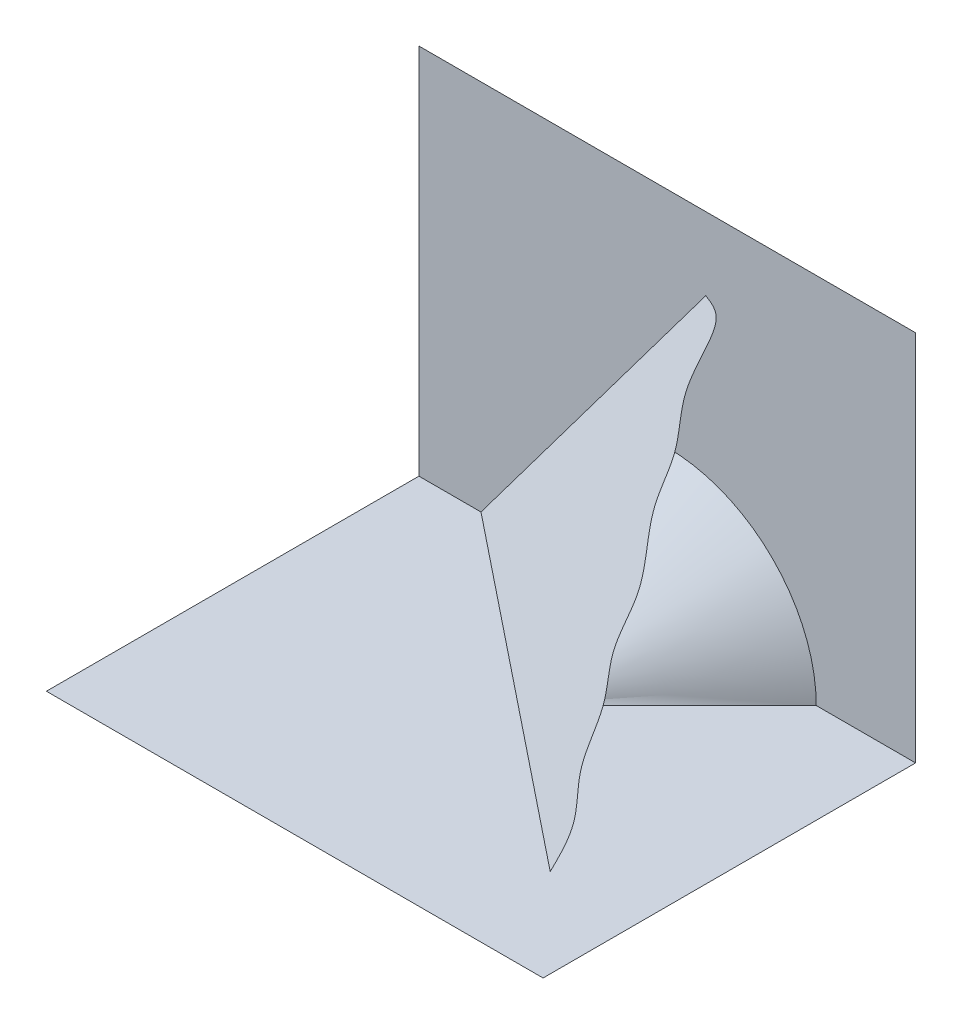
ISO-10303-21;
HEADER;
FILE_DESCRIPTION(('STEP AP214'),'2;1');
FILE_NAME('part.step','',(''),(''),'','','');
FILE_SCHEMA(('AUTOMOTIVE_DESIGN { 1 0 10303 214 1 1 1 1 }'));
ENDSEC;
DATA;
#1=APPLICATION_CONTEXT('core data for automotive mechanical design processes');
#2=APPLICATION_PROTOCOL_DEFINITION('international standard','automotive_design',2000,#1);
#3=PRODUCT_CONTEXT('',#1,'mechanical');
#4=PRODUCT('Part','Part','',(#3));
#5=PRODUCT_RELATED_PRODUCT_CATEGORY('part','',(#4));
#6=PRODUCT_DEFINITION_FORMATION('','',#4);
#7=PRODUCT_DEFINITION_CONTEXT('part definition',#1,'design');
#8=PRODUCT_DEFINITION('design','',#6,#7);
#9=PRODUCT_DEFINITION_SHAPE('','',#8);
#10=(LENGTH_UNIT() NAMED_UNIT(*) SI_UNIT(.MILLI.,.METRE.));
#11=(NAMED_UNIT(*) PLANE_ANGLE_UNIT() SI_UNIT($,.RADIAN.));
#12=(NAMED_UNIT(*) SI_UNIT($,.STERADIAN.) SOLID_ANGLE_UNIT());
#13=UNCERTAINTY_MEASURE_WITH_UNIT(LENGTH_MEASURE(1.E-05),#10,'distance_accuracy_value','');
#14=(GEOMETRIC_REPRESENTATION_CONTEXT(3) GLOBAL_UNCERTAINTY_ASSIGNED_CONTEXT((#13)) GLOBAL_UNIT_ASSIGNED_CONTEXT((#10,
#11,#12)) REPRESENTATION_CONTEXT('',''));
#15=CARTESIAN_POINT('',(0.,0.,0.));
#16=DIRECTION('',(0.,0.,1.));
#17=DIRECTION('',(1.,0.,0.));
#18=AXIS2_PLACEMENT_3D('',#15,#16,#17);
#19=CARTESIAN_POINT('',(-124.655315760703,34.6456208410821,-60.5116251132114));
#20=DIRECTION('',(0.565685424949241,-0.424264068711918,-0.707106781186551));
#21=DIRECTION('',(-0.78086880944303,0.,-0.624695047554424));
#22=AXIS2_PLACEMENT_3D('',#19,#20,#21);
#23=PLANE('',#22);
#24=DIRECTION('',(0.78086880944303,0.,0.624695047554424));
#25=VECTOR('',#24,1.);
#26=CARTESIAN_POINT('',(-75.,0.,0.));
#27=LINE('',#26,#25);
#28=CARTESIAN_POINT('',(-75.,0.,0.));
#29=VERTEX_POINT('',#28);
#30=CARTESIAN_POINT('',(64.3523649678365,0.,111.481891974269));
#31=VERTEX_POINT('',#30);
#32=EDGE_CURVE('E62',#29,#31,#27,.T.);
#33=ORIENTED_EDGE('',*,*,#32,.F.);
#34=DIRECTION('',(-0.599999999999989,-0.800000000000008,0.));
#35=VECTOR('',#34,1.);
#36=CARTESIAN_POINT('',(15.4989769693977,120.665302625867,0.));
#37=LINE('',#36,#35);
#38=CARTESIAN_POINT('',(15.4989769693977,120.665302625867,0.));
#39=VERTEX_POINT('',#38);
#40=EDGE_CURVE('E14',#39,#29,#37,.T.);
#41=ORIENTED_EDGE('',*,*,#40,.F.);
#42=CARTESIAN_POINT('',(15.4989769693977,120.665302625867,0.));
#43=CARTESIAN_POINT('',(21.5789588775473,122.822169246797,3.56986555396193));
#44=CARTESIAN_POINT('',(35.2287448887328,127.664415206591,11.5843467870341));
#45=CARTESIAN_POINT('',(22.0627522114729,100.219627160289,17.5184254730065));
#46=CARTESIAN_POINT('',(39.2977850150523,96.1403333505515,33.7540280017126));
#47=CARTESIAN_POINT('',(34.1060981240564,76.1887740674631,41.5716140587686));
#48=CARTESIAN_POINT('',(43.9859310495009,72.1597379928435,51.8929020438959));
#49=CARTESIAN_POINT('',(47.8471300154528,67.0195056762254,58.0660006066283));
#50=CARTESIAN_POINT('',(50.5415224714194,61.6781313006729,63.4263391967329));
#51=CARTESIAN_POINT('',(44.2440197505353,46.0050588030253,67.7921805186139));
#52=CARTESIAN_POINT('',(59.0354841852894,40.4319111877932,82.9692406355564));
#53=CARTESIAN_POINT('',(53.4610366285265,20.6054425411956,90.4055637781042));
#54=CARTESIAN_POINT('',(70.4458602390374,17.5136796981322,105.848480372351));
#55=CARTESIAN_POINT('',(66.3621391917909,5.77641246236065,109.623863876016));
#56=CARTESIAN_POINT('',(64.3523649678365,0.,111.481891974269));
#57=B_SPLINE_CURVE_WITH_KNOTS('',3,(#42,#43,#44,#45,#46,#47,#48,#49,#50,#51,#52,#53,#54,#55,
#56),.UNSPECIFIED.,.F.,.F.,(4,1,1,1,1,2,1,1,1,1,1,4),(0.,0.0904991285941138,0.20317391699022,
0.305672182113963,0.388577354733606,0.5,0.531406468520459,0.632577409717396,0.71619283421729,
0.820180335523914,0.911503033032128,1.),.UNSPECIFIED.);
#58=EDGE_CURVE('E69',#31,#39,#57,.F.);
#59=ORIENTED_EDGE('',*,*,#58,.F.);
#60=EDGE_LOOP('',(#33,#41,#59));
#61=FACE_BOUND('',#60,.T.);
#62=ADVANCED_FACE('F53',(#61),#23,.T.);
#63=OPEN_SHELL('',(#62));
#64=SHELL_BASED_SURFACE_MODEL('B2',(#63));
#65=CARTESIAN_POINT('',(60.0000000000006,-4.1897800333313E-13,0.));
#66=DIRECTION('',(0.,0.,1.));
#67=DIRECTION('',(1.,0.,0.));
#68=AXIS2_PLACEMENT_3D('',#65,#66,#67);
#69=PLANE('',#68);
#70=CARTESIAN_POINT('',(0.,0.,0.));
#71=DIRECTION('',(0.,0.,1.));
#72=DIRECTION('',(1.,0.,0.));
#73=AXIS2_PLACEMENT_3D('',#70,#71,#72);
#74=CIRCLE('',#73,60.0000000000006);
#75=CARTESIAN_POINT('',(60.0000000000006,-4.1897800333313E-13,0.));
#76=VERTEX_POINT('',#75);
#77=CARTESIAN_POINT('',(-60.0000000000006,0.,0.));
#78=VERTEX_POINT('',#77);
#79=EDGE_CURVE('E51',#76,#78,#74,.T.);
#80=ORIENTED_EDGE('',*,*,#79,.F.);
#81=DIRECTION('',(1.,0.,0.));
#82=VECTOR('',#81,1.);
#83=CARTESIAN_POINT('',(60.0000000000006,-4.1897800333313E-13,0.));
#84=LINE('',#83,#82);
#85=EDGE_CURVE('E132',#78,#76,#84,.T.);
#86=ORIENTED_EDGE('',*,*,#85,.F.);
#87=EDGE_LOOP('',(#80,#86));
#88=FACE_BOUND('',#87,.T.);
#89=ADVANCED_FACE('F110',(#88),#69,.F.);
#90=CARTESIAN_POINT('',(0.,0.,0.));
#91=DIRECTION('',(0.,0.,-1.));
#92=DIRECTION('',(-1.,0.,0.));
#93=AXIS2_PLACEMENT_3D('',#90,#91,#92);
#94=CONICAL_SURFACE('',#93,60.0000000000006,0.785398163397454);
#95=DIRECTION('',(0.707106781186551,0.,0.707106781186544));
#96=VECTOR('',#95,1.);
#97=CARTESIAN_POINT('',(-60.0000000000006,0.,0.));
#98=LINE('',#97,#96);
#99=CARTESIAN_POINT('',(0.,0.,60.));
#100=VERTEX_POINT('',#99);
#101=EDGE_CURVE('E124',#78,#100,#98,.T.);
#102=ORIENTED_EDGE('',*,*,#101,.T.);
#103=DIRECTION('',(-0.707106781186551,0.,0.707106781186544));
#104=VECTOR('',#103,1.);
#105=CARTESIAN_POINT('',(60.0000000000006,-4.1897800333313E-13,0.));
#106=LINE('',#105,#104);
#107=EDGE_CURVE('E118',#76,#100,#106,.T.);
#108=ORIENTED_EDGE('',*,*,#107,.F.);
#109=ORIENTED_EDGE('',*,*,#79,.T.);
#110=EDGE_LOOP('',(#102,#108,#109));
#111=FACE_BOUND('',#110,.T.);
#112=ADVANCED_FACE('F112',(#111),#94,.T.);
#113=CARTESIAN_POINT('',(0.,0.,0.));
#114=DIRECTION('',(0.,-1.,0.));
#115=DIRECTION('',(0.,0.,1.));
#116=AXIS2_PLACEMENT_3D('',#113,#114,#115);
#117=PLANE('',#116);
#118=ORIENTED_EDGE('',*,*,#85,.T.);
#119=ORIENTED_EDGE('',*,*,#107,.T.);
#120=ORIENTED_EDGE('',*,*,#101,.F.);
#121=EDGE_LOOP('',(#118,#119,#120));
#122=FACE_BOUND('',#121,.T.);
#123=ADVANCED_FACE('F135',(#122),#117,.T.);
#124=CLOSED_SHELL('',(#89,#112,#123));
#125=MANIFOLD_SOLID_BREP('B8',#124);
#126=CARTESIAN_POINT('',(-100.,-0.0001,0.));
#127=DIRECTION('',(-1.,0.,0.));
#128=DIRECTION('',(0.,0.,1.));
#129=AXIS2_PLACEMENT_3D('',#126,#127,#128);
#130=PLANE('',#129);
#131=DIRECTION('',(0.,0.,1.));
#132=VECTOR('',#131,1.);
#133=CARTESIAN_POINT('',(-100.,0.,0.));
#134=LINE('',#133,#132);
#135=CARTESIAN_POINT('',(-100.,0.,0.));
#136=VERTEX_POINT('',#135);
#137=CARTESIAN_POINT('',(-100.,0.,150.));
#138=VERTEX_POINT('',#137);
#139=EDGE_CURVE('E207',#136,#138,#134,.T.);
#140=ORIENTED_EDGE('',*,*,#139,.F.);
#141=DIRECTION('',(0.,1.,0.));
#142=VECTOR('',#141,1.);
#143=CARTESIAN_POINT('',(-100.,-0.0001,0.));
#144=LINE('',#143,#142);
#145=CARTESIAN_POINT('',(-100.,-0.0001,0.));
#146=VERTEX_POINT('',#145);
#147=EDGE_CURVE('E108',#146,#136,#144,.T.);
#148=ORIENTED_EDGE('',*,*,#147,.F.);
#149=DIRECTION('',(0.,0.,1.));
#150=VECTOR('',#149,1.);
#151=CARTESIAN_POINT('',(-100.,-0.0001,0.));
#152=LINE('',#151,#150);
#153=CARTESIAN_POINT('',(-100.,-0.0001,150.));
#154=VERTEX_POINT('',#153);
#155=EDGE_CURVE('E209',#146,#154,#152,.T.);
#156=ORIENTED_EDGE('',*,*,#155,.T.);
#157=DIRECTION('',(0.,1.,0.));
#158=VECTOR('',#157,1.);
#159=CARTESIAN_POINT('',(-100.,-0.0001,150.));
#160=LINE('',#159,#158);
#161=EDGE_CURVE('E170',#154,#138,#160,.T.);
#162=ORIENTED_EDGE('',*,*,#161,.T.);
#163=EDGE_LOOP('',(#140,#148,#156,#162));
#164=FACE_BOUND('',#163,.T.);
#165=ADVANCED_FACE('F167',(#164),#130,.T.);
#166=CARTESIAN_POINT('',(-100.,-0.0001,0.));
#167=DIRECTION('',(0.,0.,-1.));
#168=DIRECTION('',(-1.,0.,0.));
#169=AXIS2_PLACEMENT_3D('',#166,#167,#168);
#170=PLANE('',#169);
#171=DIRECTION('',(-1.,0.,0.));
#172=VECTOR('',#171,1.);
#173=CARTESIAN_POINT('',(-100.,0.,0.));
#174=LINE('',#173,#172);
#175=CARTESIAN_POINT('',(100.,0.,0.));
#176=VERTEX_POINT('',#175);
#177=EDGE_CURVE('E224',#176,#136,#174,.T.);
#178=ORIENTED_EDGE('',*,*,#177,.F.);
#179=DIRECTION('',(0.,1.,0.));
#180=VECTOR('',#179,1.);
#181=CARTESIAN_POINT('',(100.,-0.0001,0.));
#182=LINE('',#181,#180);
#183=CARTESIAN_POINT('',(100.,-0.0001,0.));
#184=VERTEX_POINT('',#183);
#185=EDGE_CURVE('E175',#184,#176,#182,.T.);
#186=ORIENTED_EDGE('',*,*,#185,.F.);
#187=DIRECTION('',(-1.,0.,0.));
#188=VECTOR('',#187,1.);
#189=CARTESIAN_POINT('',(-100.,-0.0001,0.));
#190=LINE('',#189,#188);
#191=EDGE_CURVE('E214',#184,#146,#190,.T.);
#192=ORIENTED_EDGE('',*,*,#191,.T.);
#193=ORIENTED_EDGE('',*,*,#147,.T.);
#194=EDGE_LOOP('',(#178,#186,#192,#193));
#195=FACE_BOUND('',#194,.T.);
#196=ADVANCED_FACE('F239',(#195),#170,.T.);
#197=CARTESIAN_POINT('',(100.,-0.0001,0.));
#198=DIRECTION('',(1.,0.,0.));
#199=DIRECTION('',(0.,0.,-1.));
#200=AXIS2_PLACEMENT_3D('',#197,#198,#199);
#201=PLANE('',#200);
#202=DIRECTION('',(0.,0.,-1.));
#203=VECTOR('',#202,1.);
#204=CARTESIAN_POINT('',(100.,0.,0.));
#205=LINE('',#204,#203);
#206=CARTESIAN_POINT('',(100.,0.,150.));
#207=VERTEX_POINT('',#206);
#208=EDGE_CURVE('E221',#207,#176,#205,.T.);
#209=ORIENTED_EDGE('',*,*,#208,.F.);
#210=DIRECTION('',(0.,1.,0.));
#211=VECTOR('',#210,1.);
#212=CARTESIAN_POINT('',(100.,-0.0001,150.));
#213=LINE('',#212,#211);
#214=CARTESIAN_POINT('',(100.,-0.0001,150.));
#215=VERTEX_POINT('',#214);
#216=EDGE_CURVE('E213',#215,#207,#213,.T.);
#217=ORIENTED_EDGE('',*,*,#216,.F.);
#218=DIRECTION('',(0.,0.,-1.));
#219=VECTOR('',#218,1.);
#220=CARTESIAN_POINT('',(100.,-0.0001,0.));
#221=LINE('',#220,#219);
#222=EDGE_CURVE('E232',#215,#184,#221,.T.);
#223=ORIENTED_EDGE('',*,*,#222,.T.);
#224=ORIENTED_EDGE('',*,*,#185,.T.);
#225=EDGE_LOOP('',(#209,#217,#223,#224));
#226=FACE_BOUND('',#225,.T.);
#227=ADVANCED_FACE('F236',(#226),#201,.T.);
#228=CARTESIAN_POINT('',(-100.,-0.0001,150.));
#229=DIRECTION('',(0.,0.,1.));
#230=DIRECTION('',(1.,0.,0.));
#231=AXIS2_PLACEMENT_3D('',#228,#229,#230);
#232=PLANE('',#231);
#233=DIRECTION('',(1.,0.,0.));
#234=VECTOR('',#233,1.);
#235=CARTESIAN_POINT('',(-100.,0.,150.));
#236=LINE('',#235,#234);
#237=EDGE_CURVE('E216',#138,#207,#236,.T.);
#238=ORIENTED_EDGE('',*,*,#237,.F.);
#239=ORIENTED_EDGE('',*,*,#161,.F.);
#240=DIRECTION('',(1.,0.,0.));
#241=VECTOR('',#240,1.);
#242=CARTESIAN_POINT('',(-100.,-0.0001,150.));
#243=LINE('',#242,#241);
#244=EDGE_CURVE('E230',#154,#215,#243,.T.);
#245=ORIENTED_EDGE('',*,*,#244,.T.);
#246=ORIENTED_EDGE('',*,*,#216,.T.);
#247=EDGE_LOOP('',(#238,#239,#245,#246));
#248=FACE_BOUND('',#247,.T.);
#249=ADVANCED_FACE('F217',(#248),#232,.T.);
#250=CARTESIAN_POINT('',(-100.,-0.0001,150.));
#251=DIRECTION('',(0.,1.,0.));
#252=DIRECTION('',(0.,0.,1.));
#253=AXIS2_PLACEMENT_3D('',#250,#251,#252);
#254=PLANE('',#253);
#255=ORIENTED_EDGE('',*,*,#155,.F.);
#256=ORIENTED_EDGE('',*,*,#191,.F.);
#257=ORIENTED_EDGE('',*,*,#222,.F.);
#258=ORIENTED_EDGE('',*,*,#244,.F.);
#259=EDGE_LOOP('',(#255,#256,#257,#258));
#260=FACE_BOUND('',#259,.T.);
#261=ADVANCED_FACE('F241',(#260),#254,.F.);
#262=CARTESIAN_POINT('',(-100.,0.,150.));
#263=DIRECTION('',(0.,1.,0.));
#264=DIRECTION('',(0.,0.,1.));
#265=AXIS2_PLACEMENT_3D('',#262,#263,#264);
#266=PLANE('',#265);
#267=ORIENTED_EDGE('',*,*,#139,.T.);
#268=ORIENTED_EDGE('',*,*,#237,.T.);
#269=ORIENTED_EDGE('',*,*,#208,.T.);
#270=ORIENTED_EDGE('',*,*,#177,.T.);
#271=EDGE_LOOP('',(#267,#268,#269,#270));
#272=FACE_BOUND('',#271,.T.);
#273=ADVANCED_FACE('F223',(#272),#266,.T.);
#274=CLOSED_SHELL('',(#165,#196,#227,#249,#261,#273));
#275=MANIFOLD_SOLID_BREP('B45',#274);
#276=CARTESIAN_POINT('',(-100.,150.,-0.0001));
#277=DIRECTION('',(-1.,0.,0.));
#278=DIRECTION('',(0.,-1.,0.));
#279=AXIS2_PLACEMENT_3D('',#276,#277,#278);
#280=PLANE('',#279);
#281=DIRECTION('',(0.,-1.,0.));
#282=VECTOR('',#281,1.);
#283=CARTESIAN_POINT('',(-100.,150.,0.));
#284=LINE('',#283,#282);
#285=CARTESIAN_POINT('',(-100.,150.,0.));
#286=VERTEX_POINT('',#285);
#287=CARTESIAN_POINT('',(-100.,0.,0.));
#288=VERTEX_POINT('',#287);
#289=EDGE_CURVE('E318',#286,#288,#284,.T.);
#290=ORIENTED_EDGE('',*,*,#289,.F.);
#291=DIRECTION('',(0.,0.,1.));
#292=VECTOR('',#291,1.);
#293=CARTESIAN_POINT('',(-100.,150.,-0.0001));
#294=LINE('',#293,#292);
#295=CARTESIAN_POINT('',(-100.,150.,-0.0001));
#296=VERTEX_POINT('',#295);
#297=EDGE_CURVE('E165',#296,#286,#294,.T.);
#298=ORIENTED_EDGE('',*,*,#297,.F.);
#299=DIRECTION('',(0.,-1.,0.));
#300=VECTOR('',#299,1.);
#301=CARTESIAN_POINT('',(-100.,150.,-0.0001));
#302=LINE('',#301,#300);
#303=CARTESIAN_POINT('',(-100.,0.,-0.0001));
#304=VERTEX_POINT('',#303);
#305=EDGE_CURVE('E320',#296,#304,#302,.T.);
#306=ORIENTED_EDGE('',*,*,#305,.T.);
#307=DIRECTION('',(0.,0.,1.));
#308=VECTOR('',#307,1.);
#309=CARTESIAN_POINT('',(-100.,0.,-0.0001));
#310=LINE('',#309,#308);
#311=EDGE_CURVE('E281',#304,#288,#310,.T.);
#312=ORIENTED_EDGE('',*,*,#311,.T.);
#313=EDGE_LOOP('',(#290,#298,#306,#312));
#314=FACE_BOUND('',#313,.T.);
#315=ADVANCED_FACE('F278',(#314),#280,.T.);
#316=CARTESIAN_POINT('',(-100.,150.,-0.0001));
#317=DIRECTION('',(0.,1.,0.));
#318=DIRECTION('',(0.,0.,1.));
#319=AXIS2_PLACEMENT_3D('',#316,#317,#318);
#320=PLANE('',#319);
#321=DIRECTION('',(-1.,0.,0.));
#322=VECTOR('',#321,1.);
#323=CARTESIAN_POINT('',(-100.,150.,0.));
#324=LINE('',#323,#322);
#325=CARTESIAN_POINT('',(100.,150.,0.));
#326=VERTEX_POINT('',#325);
#327=EDGE_CURVE('E335',#326,#286,#324,.T.);
#328=ORIENTED_EDGE('',*,*,#327,.F.);
#329=DIRECTION('',(0.,0.,1.));
#330=VECTOR('',#329,1.);
#331=CARTESIAN_POINT('',(100.,150.,-0.0001));
#332=LINE('',#331,#330);
#333=CARTESIAN_POINT('',(100.,150.,-0.0001));
#334=VERTEX_POINT('',#333);
#335=EDGE_CURVE('E286',#334,#326,#332,.T.);
#336=ORIENTED_EDGE('',*,*,#335,.F.);
#337=DIRECTION('',(-1.,0.,0.));
#338=VECTOR('',#337,1.);
#339=CARTESIAN_POINT('',(-100.,150.,-0.0001));
#340=LINE('',#339,#338);
#341=EDGE_CURVE('E325',#334,#296,#340,.T.);
#342=ORIENTED_EDGE('',*,*,#341,.T.);
#343=ORIENTED_EDGE('',*,*,#297,.T.);
#344=EDGE_LOOP('',(#328,#336,#342,#343));
#345=FACE_BOUND('',#344,.T.);
#346=ADVANCED_FACE('F350',(#345),#320,.T.);
#347=CARTESIAN_POINT('',(100.,150.,-0.0001));
#348=DIRECTION('',(1.,0.,0.));
#349=DIRECTION('',(0.,1.,0.));
#350=AXIS2_PLACEMENT_3D('',#347,#348,#349);
#351=PLANE('',#350);
#352=DIRECTION('',(0.,1.,0.));
#353=VECTOR('',#352,1.);
#354=CARTESIAN_POINT('',(100.,150.,0.));
#355=LINE('',#354,#353);
#356=CARTESIAN_POINT('',(100.,0.,0.));
#357=VERTEX_POINT('',#356);
#358=EDGE_CURVE('E332',#357,#326,#355,.T.);
#359=ORIENTED_EDGE('',*,*,#358,.F.);
#360=DIRECTION('',(0.,0.,1.));
#361=VECTOR('',#360,1.);
#362=CARTESIAN_POINT('',(100.,0.,-0.0001));
#363=LINE('',#362,#361);
#364=CARTESIAN_POINT('',(100.,0.,-0.0001));
#365=VERTEX_POINT('',#364);
#366=EDGE_CURVE('E324',#365,#357,#363,.T.);
#367=ORIENTED_EDGE('',*,*,#366,.F.);
#368=DIRECTION('',(0.,1.,0.));
#369=VECTOR('',#368,1.);
#370=CARTESIAN_POINT('',(100.,150.,-0.0001));
#371=LINE('',#370,#369);
#372=EDGE_CURVE('E343',#365,#334,#371,.T.);
#373=ORIENTED_EDGE('',*,*,#372,.T.);
#374=ORIENTED_EDGE('',*,*,#335,.T.);
#375=EDGE_LOOP('',(#359,#367,#373,#374));
#376=FACE_BOUND('',#375,.T.);
#377=ADVANCED_FACE('F347',(#376),#351,.T.);
#378=CARTESIAN_POINT('',(-100.,0.,-0.0001));
#379=DIRECTION('',(0.,-1.,0.));
#380=DIRECTION('',(0.,0.,-1.));
#381=AXIS2_PLACEMENT_3D('',#378,#379,#380);
#382=PLANE('',#381);
#383=DIRECTION('',(1.,0.,0.));
#384=VECTOR('',#383,1.);
#385=CARTESIAN_POINT('',(-100.,0.,0.));
#386=LINE('',#385,#384);
#387=EDGE_CURVE('E327',#288,#357,#386,.T.);
#388=ORIENTED_EDGE('',*,*,#387,.F.);
#389=ORIENTED_EDGE('',*,*,#311,.F.);
#390=DIRECTION('',(1.,0.,0.));
#391=VECTOR('',#390,1.);
#392=CARTESIAN_POINT('',(-100.,0.,-0.0001));
#393=LINE('',#392,#391);
#394=EDGE_CURVE('E341',#304,#365,#393,.T.);
#395=ORIENTED_EDGE('',*,*,#394,.T.);
#396=ORIENTED_EDGE('',*,*,#366,.T.);
#397=EDGE_LOOP('',(#388,#389,#395,#396));
#398=FACE_BOUND('',#397,.T.);
#399=ADVANCED_FACE('F328',(#398),#382,.T.);
#400=CARTESIAN_POINT('',(-100.,0.,-0.0001));
#401=DIRECTION('',(0.,0.,1.));
#402=DIRECTION('',(1.,0.,0.));
#403=AXIS2_PLACEMENT_3D('',#400,#401,#402);
#404=PLANE('',#403);
#405=ORIENTED_EDGE('',*,*,#305,.F.);
#406=ORIENTED_EDGE('',*,*,#341,.F.);
#407=ORIENTED_EDGE('',*,*,#372,.F.);
#408=ORIENTED_EDGE('',*,*,#394,.F.);
#409=EDGE_LOOP('',(#405,#406,#407,#408));
#410=FACE_BOUND('',#409,.T.);
#411=ADVANCED_FACE('F352',(#410),#404,.F.);
#412=CARTESIAN_POINT('',(-100.,0.,0.));
#413=DIRECTION('',(0.,0.,1.));
#414=DIRECTION('',(1.,0.,0.));
#415=AXIS2_PLACEMENT_3D('',#412,#413,#414);
#416=PLANE('',#415);
#417=ORIENTED_EDGE('',*,*,#289,.T.);
#418=ORIENTED_EDGE('',*,*,#387,.T.);
#419=ORIENTED_EDGE('',*,*,#358,.T.);
#420=ORIENTED_EDGE('',*,*,#327,.T.);
#421=EDGE_LOOP('',(#417,#418,#419,#420));
#422=FACE_BOUND('',#421,.T.);
#423=ADVANCED_FACE('F334',(#422),#416,.T.);
#424=CLOSED_SHELL('',(#315,#346,#377,#399,#411,#423));
#425=MANIFOLD_SOLID_BREP('B102',#424);
#426=ADVANCED_BREP_SHAPE_REPRESENTATION('',(#18,#125,#275,#425),#14);
#427=MANIFOLD_SURFACE_SHAPE_REPRESENTATION('',(#18,#64),#14);
#428=SHAPE_REPRESENTATION('',(#18),#14);
#429=SHAPE_DEFINITION_REPRESENTATION(#9,#428);
#430=SHAPE_REPRESENTATION_RELATIONSHIP('','',#428,#426);
#431=SHAPE_REPRESENTATION_RELATIONSHIP('','',#428,#427);
ENDSEC;
END-ISO-10303-21;
